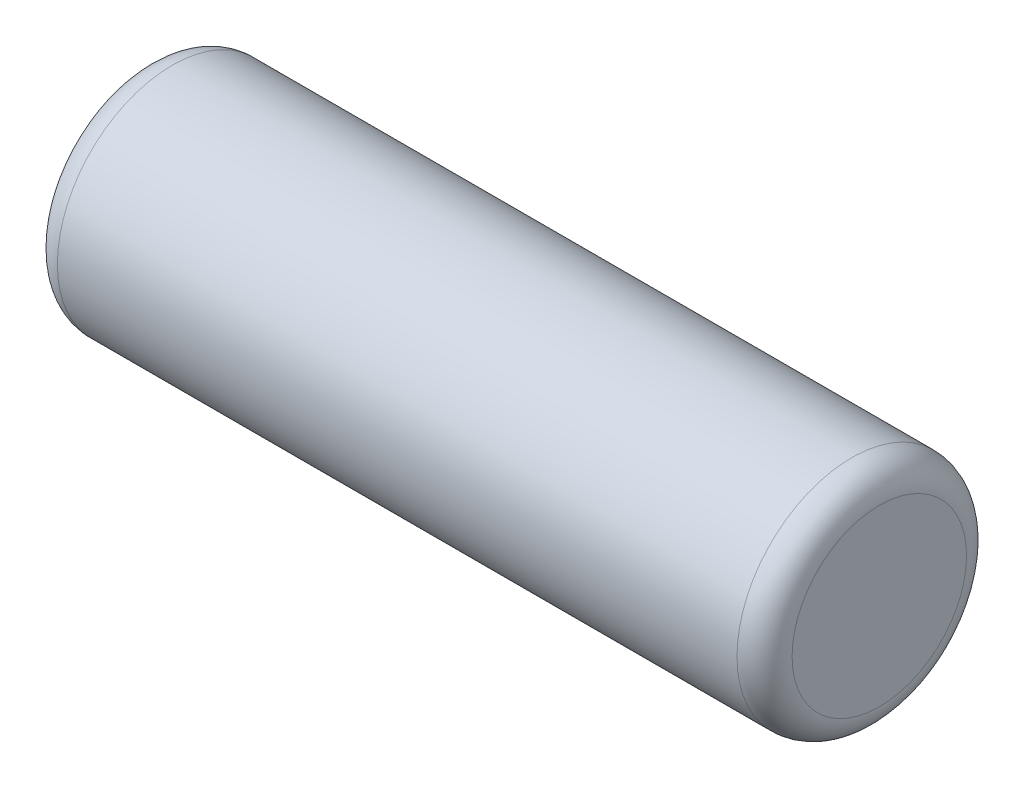
ISO-10303-21;
HEADER;
FILE_DESCRIPTION(('STEP AP214'),'2;1');
FILE_NAME('part.step','',(''),(''),'','','');
FILE_SCHEMA(('AUTOMOTIVE_DESIGN { 1 0 10303 214 1 1 1 1 }'));
ENDSEC;
DATA;
#1=APPLICATION_CONTEXT('core data for automotive mechanical design processes');
#2=APPLICATION_PROTOCOL_DEFINITION('international standard','automotive_design',2000,#1);
#3=PRODUCT_CONTEXT('',#1,'mechanical');
#4=PRODUCT('Part','Part','',(#3));
#5=PRODUCT_RELATED_PRODUCT_CATEGORY('part','',(#4));
#6=PRODUCT_DEFINITION_FORMATION('','',#4);
#7=PRODUCT_DEFINITION_CONTEXT('part definition',#1,'design');
#8=PRODUCT_DEFINITION('design','',#6,#7);
#9=PRODUCT_DEFINITION_SHAPE('','',#8);
#10=(LENGTH_UNIT() NAMED_UNIT(*) SI_UNIT(.MILLI.,.METRE.));
#11=(NAMED_UNIT(*) PLANE_ANGLE_UNIT() SI_UNIT($,.RADIAN.));
#12=(NAMED_UNIT(*) SI_UNIT($,.STERADIAN.) SOLID_ANGLE_UNIT());
#13=UNCERTAINTY_MEASURE_WITH_UNIT(LENGTH_MEASURE(1.E-05),#10,'distance_accuracy_value','');
#14=(GEOMETRIC_REPRESENTATION_CONTEXT(3) GLOBAL_UNCERTAINTY_ASSIGNED_CONTEXT((#13)) GLOBAL_UNIT_ASSIGNED_CONTEXT((#10,
#11,#12)) REPRESENTATION_CONTEXT('',''));
#15=CARTESIAN_POINT('',(0.,0.,0.));
#16=DIRECTION('',(0.,0.,1.));
#17=DIRECTION('',(1.,0.,0.));
#18=AXIS2_PLACEMENT_3D('',#15,#16,#17);
#19=CARTESIAN_POINT('',(-4.00000000000021,1.11022302462516E-13,0.));
#20=DIRECTION('',(1.00000000000003,0.,0.));
#21=DIRECTION('',(0.,0.,-1.));
#22=AXIS2_PLACEMENT_3D('',#19,#20,#21);
#23=PLANE('',#22);
#24=CARTESIAN_POINT('',(-4.00000000000021,1.11022302462516E-13,0.));
#25=DIRECTION('',(1.00000000000003,0.,0.));
#26=DIRECTION('',(0.,0.,-1.));
#27=AXIS2_PLACEMENT_3D('',#24,#25,#26);
#28=CIRCLE('',#27,0.95);
#29=CARTESIAN_POINT('',(-4.00000000000021,1.12815312647285E-13,-0.95));
#30=VERTEX_POINT('',#29);
#31=EDGE_CURVE('E10',#30,#30,#28,.F.);
#32=ORIENTED_EDGE('',*,*,#31,.T.);
#33=EDGE_LOOP('',(#32));
#34=FACE_BOUND('',#33,.T.);
#35=ADVANCED_FACE('F38',(#34),#23,.F.);
#36=CARTESIAN_POINT('',(-17.0000000000006,2.22044604925031E-13,0.));
#37=DIRECTION('',(-1.00000000000003,0.,0.));
#38=DIRECTION('',(0.,0.,1.));
#39=AXIS2_PLACEMENT_3D('',#36,#37,#38);
#40=CYLINDRICAL_SURFACE('',#39,1.25);
#41=CARTESIAN_POINT('',(3.70000000000021,2.4980018054066E-13,0.));
#42=DIRECTION('',(-1.00000000000003,0.,0.));
#43=DIRECTION('',(0.,0.,1.));
#44=AXIS2_PLACEMENT_3D('',#41,#42,#43);
#45=CIRCLE('',#44,1.25);
#46=CARTESIAN_POINT('',(3.70000000000021,2.47440956613332E-13,1.25000000000008));
#47=VERTEX_POINT('',#46);
#48=EDGE_CURVE('E51',#47,#47,#45,.T.);
#49=ORIENTED_EDGE('',*,*,#48,.T.);
#50=EDGE_LOOP('',(#49));
#51=FACE_BOUND('',#50,.T.);
#52=CARTESIAN_POINT('',(-3.70000000000009,0.,0.));
#53=DIRECTION('',(1.00000000000003,0.,0.));
#54=DIRECTION('',(0.,0.,-1.));
#55=AXIS2_PLACEMENT_3D('',#52,#53,#54);
#56=CIRCLE('',#55,1.25);
#57=CARTESIAN_POINT('',(-3.70000000000009,0.,-1.25));
#58=VERTEX_POINT('',#57);
#59=EDGE_CURVE('E57',#58,#58,#56,.T.);
#60=ORIENTED_EDGE('',*,*,#59,.T.);
#61=EDGE_LOOP('',(#60));
#62=FACE_BOUND('',#61,.T.);
#63=ADVANCED_FACE('F65',(#51,#62),#40,.T.);
#64=CARTESIAN_POINT('',(3.99999999999998,1.52655665885959E-13,0.));
#65=DIRECTION('',(-1.00000000000003,0.,0.));
#66=DIRECTION('',(0.,0.,1.));
#67=AXIS2_PLACEMENT_3D('',#64,#65,#66);
#68=PLANE('',#67);
#69=CARTESIAN_POINT('',(3.99999999999998,1.52655665885959E-13,0.));
#70=DIRECTION('',(-1.00000000000003,0.,0.));
#71=DIRECTION('',(0.,0.,1.));
#72=AXIS2_PLACEMENT_3D('',#69,#70,#71);
#73=CIRCLE('',#72,0.95);
#74=CARTESIAN_POINT('',(3.99999999999998,1.50862655701189E-13,0.949999999999983));
#75=VERTEX_POINT('',#74);
#76=EDGE_CURVE('E45',#75,#75,#73,.F.);
#77=ORIENTED_EDGE('',*,*,#76,.T.);
#78=EDGE_LOOP('',(#77));
#79=FACE_BOUND('',#78,.T.);
#80=ADVANCED_FACE('F75',(#79),#68,.F.);
#81=CARTESIAN_POINT('',(3.70000000000021,2.4980018054066E-13,0.));
#82=DIRECTION('',(-1.00000000000003,0.,0.));
#83=DIRECTION('',(0.,0.,1.));
#84=AXIS2_PLACEMENT_3D('',#81,#82,#83);
#85=TOROIDAL_SURFACE('',#84,0.95,0.3);
#86=ORIENTED_EDGE('',*,*,#76,.F.);
#87=EDGE_LOOP('',(#86));
#88=FACE_BOUND('',#87,.T.);
#89=ORIENTED_EDGE('',*,*,#48,.F.);
#90=EDGE_LOOP('',(#89));
#91=FACE_BOUND('',#90,.T.);
#92=ADVANCED_FACE('F70',(#88,#91),#85,.T.);
#93=CARTESIAN_POINT('',(-3.70000000000009,0.,0.));
#94=DIRECTION('',(1.00000000000003,0.,0.));
#95=DIRECTION('',(0.,0.,-1.));
#96=AXIS2_PLACEMENT_3D('',#93,#94,#95);
#97=TOROIDAL_SURFACE('',#96,0.95,0.3);
#98=ORIENTED_EDGE('',*,*,#59,.F.);
#99=EDGE_LOOP('',(#98));
#100=FACE_BOUND('',#99,.T.);
#101=ORIENTED_EDGE('',*,*,#31,.F.);
#102=EDGE_LOOP('',(#101));
#103=FACE_BOUND('',#102,.T.);
#104=ADVANCED_FACE('F67',(#100,#103),#97,.T.);
#105=CLOSED_SHELL('',(#35,#63,#80,#92,#104));
#106=MANIFOLD_SOLID_BREP('B2',#105);
#107=ADVANCED_BREP_SHAPE_REPRESENTATION('',(#18,#106),#14);
#108=SHAPE_DEFINITION_REPRESENTATION(#9,#107);
ENDSEC;
END-ISO-10303-21;
